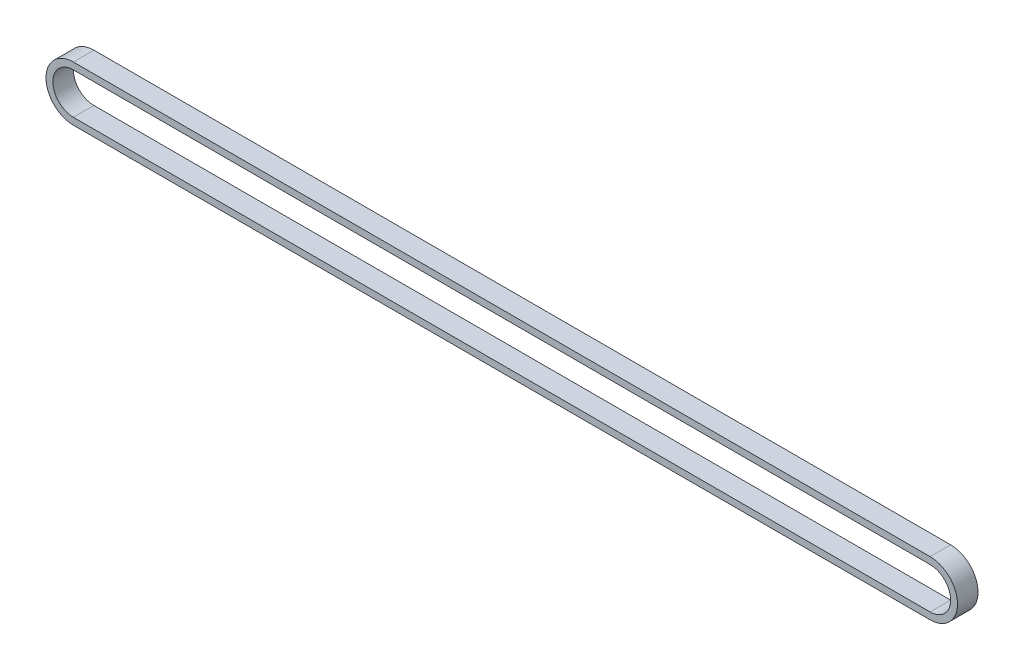
ISO-10303-21;
HEADER;
FILE_DESCRIPTION(('STEP AP214'),'2;1');
FILE_NAME('part.step','',(''),(''),'','','');
FILE_SCHEMA(('AUTOMOTIVE_DESIGN { 1 0 10303 214 1 1 1 1 }'));
ENDSEC;
DATA;
#1=APPLICATION_CONTEXT('core data for automotive mechanical design processes');
#2=APPLICATION_PROTOCOL_DEFINITION('international standard','automotive_design',2000,#1);
#3=PRODUCT_CONTEXT('',#1,'mechanical');
#4=PRODUCT('Part','Part','',(#3));
#5=PRODUCT_RELATED_PRODUCT_CATEGORY('part','',(#4));
#6=PRODUCT_DEFINITION_FORMATION('','',#4);
#7=PRODUCT_DEFINITION_CONTEXT('part definition',#1,'design');
#8=PRODUCT_DEFINITION('design','',#6,#7);
#9=PRODUCT_DEFINITION_SHAPE('','',#8);
#10=(LENGTH_UNIT() NAMED_UNIT(*) SI_UNIT(.MILLI.,.METRE.));
#11=(NAMED_UNIT(*) PLANE_ANGLE_UNIT() SI_UNIT($,.RADIAN.));
#12=(NAMED_UNIT(*) SI_UNIT($,.STERADIAN.) SOLID_ANGLE_UNIT());
#13=UNCERTAINTY_MEASURE_WITH_UNIT(LENGTH_MEASURE(1.E-05),#10,'distance_accuracy_value','');
#14=(GEOMETRIC_REPRESENTATION_CONTEXT(3) GLOBAL_UNCERTAINTY_ASSIGNED_CONTEXT((#13)) GLOBAL_UNIT_ASSIGNED_CONTEXT((#10,
#11,#12)) REPRESENTATION_CONTEXT('',''));
#15=CARTESIAN_POINT('',(0.,0.,0.));
#16=DIRECTION('',(0.,0.,1.));
#17=DIRECTION('',(1.,0.,0.));
#18=AXIS2_PLACEMENT_3D('',#15,#16,#17);
#19=CARTESIAN_POINT('',(-125.25,0.,6.));
#20=DIRECTION('',(0.,0.,1.));
#21=DIRECTION('',(1.,0.,0.));
#22=AXIS2_PLACEMENT_3D('',#19,#20,#21);
#23=PLANE('',#22);
#24=CARTESIAN_POINT('',(-125.25,0.,6.));
#25=DIRECTION('',(0.,0.,1.));
#26=DIRECTION('',(1.,0.,0.));
#27=AXIS2_PLACEMENT_3D('',#24,#25,#26);
#28=CIRCLE('',#27,8.);
#29=CARTESIAN_POINT('',(-125.25,8.,6.));
#30=VERTEX_POINT('',#29);
#31=CARTESIAN_POINT('',(-125.25,-8.,6.));
#32=VERTEX_POINT('',#31);
#33=EDGE_CURVE('E134',#30,#32,#28,.T.);
#34=ORIENTED_EDGE('',*,*,#33,.T.);
#35=DIRECTION('',(1.,0.,0.));
#36=VECTOR('',#35,1.);
#37=CARTESIAN_POINT('',(-125.25,-8.,6.));
#38=LINE('',#37,#36);
#39=CARTESIAN_POINT('',(125.25,-7.99999999999993,6.));
#40=VERTEX_POINT('',#39);
#41=EDGE_CURVE('E137',#32,#40,#38,.T.);
#42=ORIENTED_EDGE('',*,*,#41,.T.);
#43=CARTESIAN_POINT('',(125.25,0.,6.));
#44=DIRECTION('',(0.,0.,1.));
#45=DIRECTION('',(1.,0.,0.));
#46=AXIS2_PLACEMENT_3D('',#43,#44,#45);
#47=CIRCLE('',#46,7.99999999999998);
#48=CARTESIAN_POINT('',(125.25,8.,6.));
#49=VERTEX_POINT('',#48);
#50=EDGE_CURVE('E140',#40,#49,#47,.T.);
#51=ORIENTED_EDGE('',*,*,#50,.T.);
#52=DIRECTION('',(-1.,0.,0.));
#53=VECTOR('',#52,1.);
#54=CARTESIAN_POINT('',(-125.25,8.,6.));
#55=LINE('',#54,#53);
#56=EDGE_CURVE('E142',#49,#30,#55,.T.);
#57=ORIENTED_EDGE('',*,*,#56,.T.);
#58=EDGE_LOOP('',(#34,#42,#51,#57));
#59=FACE_BOUND('',#58,.T.);
#60=DIRECTION('',(1.,0.,0.));
#61=VECTOR('',#60,1.);
#62=CARTESIAN_POINT('',(-125.25,-6.,6.));
#63=LINE('',#62,#61);
#64=CARTESIAN_POINT('',(-125.25,-6.,6.));
#65=VERTEX_POINT('',#64);
#66=CARTESIAN_POINT('',(125.25,-5.99999999999995,6.));
#67=VERTEX_POINT('',#66);
#68=EDGE_CURVE('E106',#65,#67,#63,.T.);
#69=ORIENTED_EDGE('',*,*,#68,.F.);
#70=CARTESIAN_POINT('',(-125.25,0.,6.));
#71=DIRECTION('',(0.,0.,1.));
#72=DIRECTION('',(1.,0.,0.));
#73=AXIS2_PLACEMENT_3D('',#70,#71,#72);
#74=CIRCLE('',#73,6.);
#75=CARTESIAN_POINT('',(-125.25,6.,6.));
#76=VERTEX_POINT('',#75);
#77=EDGE_CURVE('E98',#76,#65,#74,.T.);
#78=ORIENTED_EDGE('',*,*,#77,.F.);
#79=DIRECTION('',(-1.,0.,0.));
#80=VECTOR('',#79,1.);
#81=CARTESIAN_POINT('',(-125.25,6.,6.));
#82=LINE('',#81,#80);
#83=CARTESIAN_POINT('',(125.25,6.00000000000005,6.));
#84=VERTEX_POINT('',#83);
#85=EDGE_CURVE('E120',#84,#76,#82,.T.);
#86=ORIENTED_EDGE('',*,*,#85,.F.);
#87=CARTESIAN_POINT('',(125.25,0.,6.));
#88=DIRECTION('',(0.,0.,1.));
#89=DIRECTION('',(1.,0.,0.));
#90=AXIS2_PLACEMENT_3D('',#87,#88,#89);
#91=CIRCLE('',#90,6.);
#92=EDGE_CURVE('E118',#67,#84,#91,.T.);
#93=ORIENTED_EDGE('',*,*,#92,.F.);
#94=EDGE_LOOP('',(#69,#78,#86,#93));
#95=FACE_BOUND('',#94,.T.);
#96=ADVANCED_FACE('F33',(#59,#95),#23,.T.);
#97=CARTESIAN_POINT('',(-125.25,0.,0.));
#98=DIRECTION('',(0.,0.,1.));
#99=DIRECTION('',(1.,0.,0.));
#100=AXIS2_PLACEMENT_3D('',#97,#98,#99);
#101=PLANE('',#100);
#102=CARTESIAN_POINT('',(-125.25,0.,0.));
#103=DIRECTION('',(0.,0.,1.));
#104=DIRECTION('',(1.,0.,0.));
#105=AXIS2_PLACEMENT_3D('',#102,#103,#104);
#106=CIRCLE('',#105,8.);
#107=CARTESIAN_POINT('',(-125.25,8.,0.));
#108=VERTEX_POINT('',#107);
#109=CARTESIAN_POINT('',(-125.25,-8.,0.));
#110=VERTEX_POINT('',#109);
#111=EDGE_CURVE('E114',#108,#110,#106,.T.);
#112=ORIENTED_EDGE('',*,*,#111,.F.);
#113=DIRECTION('',(-1.,0.,0.));
#114=VECTOR('',#113,1.);
#115=CARTESIAN_POINT('',(-125.25,8.,0.));
#116=LINE('',#115,#114);
#117=CARTESIAN_POINT('',(125.25,8.,0.));
#118=VERTEX_POINT('',#117);
#119=EDGE_CURVE('E138',#118,#108,#116,.T.);
#120=ORIENTED_EDGE('',*,*,#119,.F.);
#121=CARTESIAN_POINT('',(125.25,0.,0.));
#122=DIRECTION('',(0.,0.,1.));
#123=DIRECTION('',(1.,0.,0.));
#124=AXIS2_PLACEMENT_3D('',#121,#122,#123);
#125=CIRCLE('',#124,7.99999999999998);
#126=CARTESIAN_POINT('',(125.25,-7.99999999999993,0.));
#127=VERTEX_POINT('',#126);
#128=EDGE_CURVE('E149',#127,#118,#125,.T.);
#129=ORIENTED_EDGE('',*,*,#128,.F.);
#130=DIRECTION('',(1.,0.,0.));
#131=VECTOR('',#130,1.);
#132=CARTESIAN_POINT('',(-125.25,-8.,0.));
#133=LINE('',#132,#131);
#134=EDGE_CURVE('E147',#110,#127,#133,.T.);
#135=ORIENTED_EDGE('',*,*,#134,.F.);
#136=EDGE_LOOP('',(#112,#120,#129,#135));
#137=FACE_BOUND('',#136,.T.);
#138=CARTESIAN_POINT('',(-125.25,0.,0.));
#139=DIRECTION('',(0.,0.,1.));
#140=DIRECTION('',(1.,0.,0.));
#141=AXIS2_PLACEMENT_3D('',#138,#139,#140);
#142=CIRCLE('',#141,6.);
#143=CARTESIAN_POINT('',(-125.25,6.,0.));
#144=VERTEX_POINT('',#143);
#145=CARTESIAN_POINT('',(-125.25,-6.,0.));
#146=VERTEX_POINT('',#145);
#147=EDGE_CURVE('E56',#144,#146,#142,.T.);
#148=ORIENTED_EDGE('',*,*,#147,.T.);
#149=DIRECTION('',(1.,0.,0.));
#150=VECTOR('',#149,1.);
#151=CARTESIAN_POINT('',(-125.25,-6.,0.));
#152=LINE('',#151,#150);
#153=CARTESIAN_POINT('',(125.25,-5.99999999999995,0.));
#154=VERTEX_POINT('',#153);
#155=EDGE_CURVE('E113',#146,#154,#152,.T.);
#156=ORIENTED_EDGE('',*,*,#155,.T.);
#157=CARTESIAN_POINT('',(125.25,0.,0.));
#158=DIRECTION('',(0.,0.,1.));
#159=DIRECTION('',(1.,0.,0.));
#160=AXIS2_PLACEMENT_3D('',#157,#158,#159);
#161=CIRCLE('',#160,6.);
#162=CARTESIAN_POINT('',(125.25,6.00000000000005,0.));
#163=VERTEX_POINT('',#162);
#164=EDGE_CURVE('E126',#154,#163,#161,.T.);
#165=ORIENTED_EDGE('',*,*,#164,.T.);
#166=DIRECTION('',(-1.,0.,0.));
#167=VECTOR('',#166,1.);
#168=CARTESIAN_POINT('',(-125.25,6.,0.));
#169=LINE('',#168,#167);
#170=EDGE_CURVE('E107',#163,#144,#169,.T.);
#171=ORIENTED_EDGE('',*,*,#170,.T.);
#172=EDGE_LOOP('',(#148,#156,#165,#171));
#173=FACE_BOUND('',#172,.T.);
#174=ADVANCED_FACE('F167',(#137,#173),#101,.F.);
#175=CARTESIAN_POINT('',(-125.25,0.,6.));
#176=DIRECTION('',(0.,0.,-1.));
#177=DIRECTION('',(-1.,0.,0.));
#178=AXIS2_PLACEMENT_3D('',#175,#176,#177);
#179=CYLINDRICAL_SURFACE('',#178,8.);
#180=ORIENTED_EDGE('',*,*,#111,.T.);
#181=DIRECTION('',(0.,0.,-1.));
#182=VECTOR('',#181,1.);
#183=CARTESIAN_POINT('',(-125.25,-8.,6.));
#184=LINE('',#183,#182);
#185=EDGE_CURVE('E11',#32,#110,#184,.T.);
#186=ORIENTED_EDGE('',*,*,#185,.F.);
#187=ORIENTED_EDGE('',*,*,#33,.F.);
#188=DIRECTION('',(0.,0.,-1.));
#189=VECTOR('',#188,1.);
#190=CARTESIAN_POINT('',(-125.25,8.,6.));
#191=LINE('',#190,#189);
#192=EDGE_CURVE('E144',#30,#108,#191,.T.);
#193=ORIENTED_EDGE('',*,*,#192,.T.);
#194=EDGE_LOOP('',(#180,#186,#187,#193));
#195=FACE_BOUND('',#194,.T.);
#196=ADVANCED_FACE('F35',(#195),#179,.T.);
#197=CARTESIAN_POINT('',(-125.25,-8.,6.));
#198=DIRECTION('',(0.,1.,0.));
#199=DIRECTION('',(-1.,0.,0.));
#200=AXIS2_PLACEMENT_3D('',#197,#198,#199);
#201=PLANE('',#200);
#202=ORIENTED_EDGE('',*,*,#134,.T.);
#203=DIRECTION('',(0.,0.,-1.));
#204=VECTOR('',#203,1.);
#205=CARTESIAN_POINT('',(125.25,-7.99999999999993,6.));
#206=LINE('',#205,#204);
#207=EDGE_CURVE('E41',#40,#127,#206,.T.);
#208=ORIENTED_EDGE('',*,*,#207,.F.);
#209=ORIENTED_EDGE('',*,*,#41,.F.);
#210=ORIENTED_EDGE('',*,*,#185,.T.);
#211=EDGE_LOOP('',(#202,#208,#209,#210));
#212=FACE_BOUND('',#211,.T.);
#213=ADVANCED_FACE('F177',(#212),#201,.F.);
#214=CARTESIAN_POINT('',(125.25,0.,6.));
#215=DIRECTION('',(0.,0.,-1.));
#216=DIRECTION('',(-1.,0.,0.));
#217=AXIS2_PLACEMENT_3D('',#214,#215,#216);
#218=CYLINDRICAL_SURFACE('',#217,7.99999999999998);
#219=ORIENTED_EDGE('',*,*,#128,.T.);
#220=DIRECTION('',(0.,0.,-1.));
#221=VECTOR('',#220,1.);
#222=CARTESIAN_POINT('',(125.25,8.,6.));
#223=LINE('',#222,#221);
#224=EDGE_CURVE('E154',#49,#118,#223,.T.);
#225=ORIENTED_EDGE('',*,*,#224,.F.);
#226=ORIENTED_EDGE('',*,*,#50,.F.);
#227=ORIENTED_EDGE('',*,*,#207,.T.);
#228=EDGE_LOOP('',(#219,#225,#226,#227));
#229=FACE_BOUND('',#228,.T.);
#230=ADVANCED_FACE('F161',(#229),#218,.T.);
#231=CARTESIAN_POINT('',(-125.25,8.,6.));
#232=DIRECTION('',(0.,-1.,0.));
#233=DIRECTION('',(0.,0.,-1.));
#234=AXIS2_PLACEMENT_3D('',#231,#232,#233);
#235=PLANE('',#234);
#236=ORIENTED_EDGE('',*,*,#119,.T.);
#237=ORIENTED_EDGE('',*,*,#192,.F.);
#238=ORIENTED_EDGE('',*,*,#56,.F.);
#239=ORIENTED_EDGE('',*,*,#224,.T.);
#240=EDGE_LOOP('',(#236,#237,#238,#239));
#241=FACE_BOUND('',#240,.T.);
#242=ADVANCED_FACE('F171',(#241),#235,.F.);
#243=CARTESIAN_POINT('',(-125.25,0.,6.));
#244=DIRECTION('',(0.,0.,-1.));
#245=DIRECTION('',(-1.,0.,0.));
#246=AXIS2_PLACEMENT_3D('',#243,#244,#245);
#247=CYLINDRICAL_SURFACE('',#246,6.);
#248=ORIENTED_EDGE('',*,*,#147,.F.);
#249=DIRECTION('',(0.,0.,-1.));
#250=VECTOR('',#249,1.);
#251=CARTESIAN_POINT('',(-125.25,6.,6.));
#252=LINE('',#251,#250);
#253=EDGE_CURVE('E102',#76,#144,#252,.T.);
#254=ORIENTED_EDGE('',*,*,#253,.F.);
#255=ORIENTED_EDGE('',*,*,#77,.T.);
#256=DIRECTION('',(0.,0.,-1.));
#257=VECTOR('',#256,1.);
#258=CARTESIAN_POINT('',(-125.25,-6.,6.));
#259=LINE('',#258,#257);
#260=EDGE_CURVE('E101',#65,#146,#259,.T.);
#261=ORIENTED_EDGE('',*,*,#260,.T.);
#262=EDGE_LOOP('',(#248,#254,#255,#261));
#263=FACE_BOUND('',#262,.T.);
#264=ADVANCED_FACE('F100',(#263),#247,.F.);
#265=CARTESIAN_POINT('',(-125.25,-6.,6.));
#266=DIRECTION('',(0.,1.,0.));
#267=DIRECTION('',(-1.,0.,0.));
#268=AXIS2_PLACEMENT_3D('',#265,#266,#267);
#269=PLANE('',#268);
#270=ORIENTED_EDGE('',*,*,#155,.F.);
#271=ORIENTED_EDGE('',*,*,#260,.F.);
#272=ORIENTED_EDGE('',*,*,#68,.T.);
#273=DIRECTION('',(0.,0.,-1.));
#274=VECTOR('',#273,1.);
#275=CARTESIAN_POINT('',(125.25,-5.99999999999995,6.));
#276=LINE('',#275,#274);
#277=EDGE_CURVE('E115',#67,#154,#276,.T.);
#278=ORIENTED_EDGE('',*,*,#277,.T.);
#279=EDGE_LOOP('',(#270,#271,#272,#278));
#280=FACE_BOUND('',#279,.T.);
#281=ADVANCED_FACE('F110',(#280),#269,.T.);
#282=CARTESIAN_POINT('',(125.25,0.,6.));
#283=DIRECTION('',(0.,0.,-1.));
#284=DIRECTION('',(-1.,0.,0.));
#285=AXIS2_PLACEMENT_3D('',#282,#283,#284);
#286=CYLINDRICAL_SURFACE('',#285,6.);
#287=ORIENTED_EDGE('',*,*,#164,.F.);
#288=ORIENTED_EDGE('',*,*,#277,.F.);
#289=ORIENTED_EDGE('',*,*,#92,.T.);
#290=DIRECTION('',(0.,0.,-1.));
#291=VECTOR('',#290,1.);
#292=CARTESIAN_POINT('',(125.25,6.00000000000005,6.));
#293=LINE('',#292,#291);
#294=EDGE_CURVE('E48',#84,#163,#293,.T.);
#295=ORIENTED_EDGE('',*,*,#294,.T.);
#296=EDGE_LOOP('',(#287,#288,#289,#295));
#297=FACE_BOUND('',#296,.T.);
#298=ADVANCED_FACE('F200',(#297),#286,.F.);
#299=CARTESIAN_POINT('',(-125.25,6.,6.));
#300=DIRECTION('',(0.,-1.,0.));
#301=DIRECTION('',(1.,0.,0.));
#302=AXIS2_PLACEMENT_3D('',#299,#300,#301);
#303=PLANE('',#302);
#304=ORIENTED_EDGE('',*,*,#170,.F.);
#305=ORIENTED_EDGE('',*,*,#294,.F.);
#306=ORIENTED_EDGE('',*,*,#85,.T.);
#307=ORIENTED_EDGE('',*,*,#253,.T.);
#308=EDGE_LOOP('',(#304,#305,#306,#307));
#309=FACE_BOUND('',#308,.T.);
#310=ADVANCED_FACE('F204',(#309),#303,.T.);
#311=CLOSED_SHELL('',(#96,#174,#196,#213,#230,#242,#264,#281,#298,#310));
#312=MANIFOLD_SOLID_BREP('B2',#311);
#313=ADVANCED_BREP_SHAPE_REPRESENTATION('',(#18,#312),#14);
#314=SHAPE_DEFINITION_REPRESENTATION(#9,#313);
ENDSEC;
END-ISO-10303-21;
